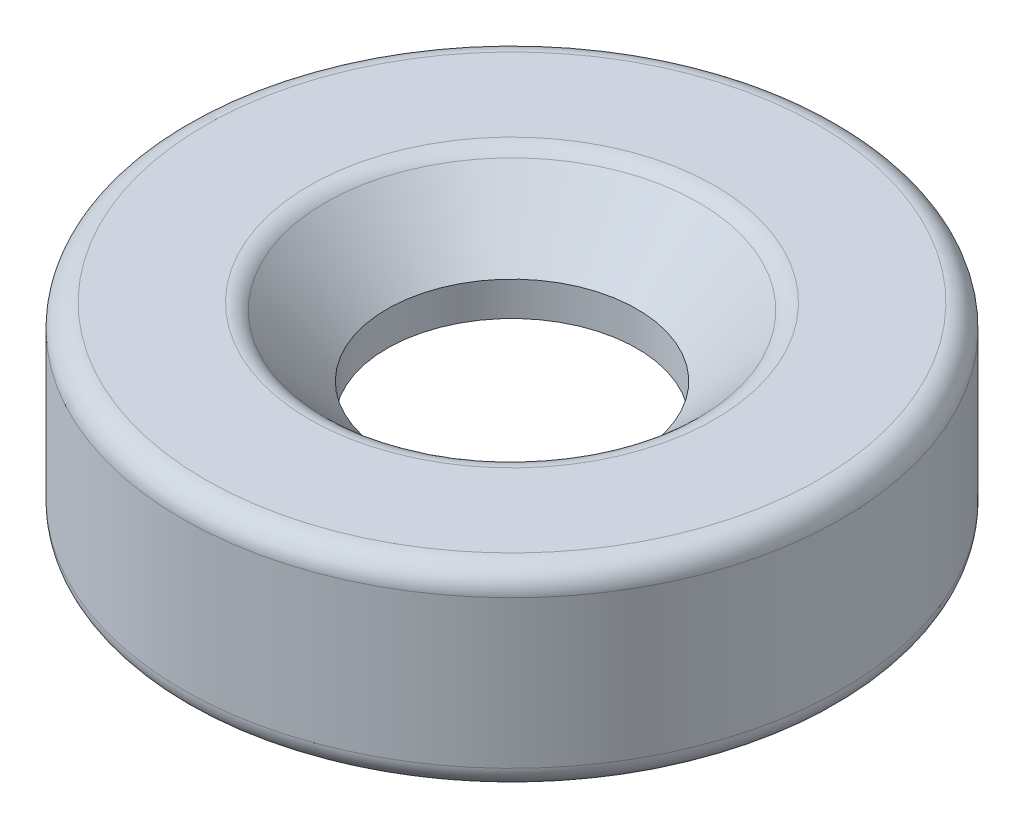
ISO-10303-21;
HEADER;
FILE_DESCRIPTION(('STEP AP214'),'2;1');
FILE_NAME('part.step','',(''),(''),'','','');
FILE_SCHEMA(('AUTOMOTIVE_DESIGN { 1 0 10303 214 1 1 1 1 }'));
ENDSEC;
DATA;
#1=APPLICATION_CONTEXT('core data for automotive mechanical design processes');
#2=APPLICATION_PROTOCOL_DEFINITION('international standard','automotive_design',2000,#1);
#3=PRODUCT_CONTEXT('',#1,'mechanical');
#4=PRODUCT('Part','Part','',(#3));
#5=PRODUCT_RELATED_PRODUCT_CATEGORY('part','',(#4));
#6=PRODUCT_DEFINITION_FORMATION('','',#4);
#7=PRODUCT_DEFINITION_CONTEXT('part definition',#1,'design');
#8=PRODUCT_DEFINITION('design','',#6,#7);
#9=PRODUCT_DEFINITION_SHAPE('','',#8);
#10=(LENGTH_UNIT() NAMED_UNIT(*) SI_UNIT(.MILLI.,.METRE.));
#11=(NAMED_UNIT(*) PLANE_ANGLE_UNIT() SI_UNIT($,.RADIAN.));
#12=(NAMED_UNIT(*) SI_UNIT($,.STERADIAN.) SOLID_ANGLE_UNIT());
#13=UNCERTAINTY_MEASURE_WITH_UNIT(LENGTH_MEASURE(1.E-05),#10,'distance_accuracy_value','');
#14=(GEOMETRIC_REPRESENTATION_CONTEXT(3) GLOBAL_UNCERTAINTY_ASSIGNED_CONTEXT((#13)) GLOBAL_UNIT_ASSIGNED_CONTEXT((#10,
#11,#12)) REPRESENTATION_CONTEXT('',''));
#15=CARTESIAN_POINT('',(0.,0.,0.));
#16=DIRECTION('',(0.,0.,1.));
#17=DIRECTION('',(1.,0.,0.));
#18=AXIS2_PLACEMENT_3D('',#15,#16,#17);
#19=CARTESIAN_POINT('',(0.,10.8346474678292,0.));
#20=DIRECTION('',(0.,1.,0.));
#21=DIRECTION('',(0.,0.,1.));
#22=AXIS2_PLACEMENT_3D('',#19,#20,#21);
#23=CYLINDRICAL_SURFACE('',#22,14.5);
#24=CARTESIAN_POINT('',(0.,0.999999999999999,0.));
#25=DIRECTION('',(0.,-1.,0.));
#26=DIRECTION('',(0.,0.,-1.));
#27=AXIS2_PLACEMENT_3D('',#24,#25,#26);
#28=CIRCLE('',#27,14.5);
#29=CARTESIAN_POINT('',(0.,0.999999999999999,-14.5));
#30=VERTEX_POINT('',#29);
#31=EDGE_CURVE('E40',#30,#30,#28,.F.);
#32=ORIENTED_EDGE('',*,*,#31,.T.);
#33=EDGE_LOOP('',(#32));
#34=FACE_BOUND('',#33,.T.);
#35=CARTESIAN_POINT('',(0.,7.5,0.));
#36=DIRECTION('',(0.,1.,0.));
#37=DIRECTION('',(0.,0.,1.));
#38=AXIS2_PLACEMENT_3D('',#35,#36,#37);
#39=CIRCLE('',#38,14.5);
#40=CARTESIAN_POINT('',(0.,7.5,14.5));
#41=VERTEX_POINT('',#40);
#42=EDGE_CURVE('E44',#41,#41,#39,.F.);
#43=ORIENTED_EDGE('',*,*,#42,.T.);
#44=EDGE_LOOP('',(#43));
#45=FACE_BOUND('',#44,.T.);
#46=ADVANCED_FACE('F33',(#34,#45),#23,.T.);
#47=CARTESIAN_POINT('',(-14.5,8.5,0.));
#48=DIRECTION('',(0.,1.,0.));
#49=DIRECTION('',(0.,0.,1.));
#50=AXIS2_PLACEMENT_3D('',#47,#48,#49);
#51=PLANE('',#50);
#52=CARTESIAN_POINT('',(0.,8.5,0.));
#53=DIRECTION('',(0.,1.,0.));
#54=DIRECTION('',(0.,0.,1.));
#55=AXIS2_PLACEMENT_3D('',#52,#53,#54);
#56=CIRCLE('',#55,8.91421356237311);
#57=CARTESIAN_POINT('',(0.,8.5,8.91421356237311));
#58=VERTEX_POINT('',#57);
#59=EDGE_CURVE('E48',#58,#58,#56,.F.);
#60=ORIENTED_EDGE('',*,*,#59,.T.);
#61=EDGE_LOOP('',(#60));
#62=FACE_BOUND('',#61,.T.);
#63=CARTESIAN_POINT('',(0.,8.5,0.));
#64=DIRECTION('',(0.,1.,0.));
#65=DIRECTION('',(0.,0.,1.));
#66=AXIS2_PLACEMENT_3D('',#63,#64,#65);
#67=CIRCLE('',#66,13.5);
#68=CARTESIAN_POINT('',(0.,8.5,13.5));
#69=VERTEX_POINT('',#68);
#70=EDGE_CURVE('E53',#69,#69,#67,.T.);
#71=ORIENTED_EDGE('',*,*,#70,.T.);
#72=EDGE_LOOP('',(#71));
#73=FACE_BOUND('',#72,.T.);
#74=ADVANCED_FACE('F96',(#62,#73),#51,.T.);
#75=CARTESIAN_POINT('',(0.,5.5,0.));
#76=DIRECTION('',(0.,1.,0.));
#77=DIRECTION('',(0.,0.,1.));
#78=AXIS2_PLACEMENT_3D('',#75,#76,#77);
#79=CONICAL_SURFACE('',#78,5.5,0.78539816339745);
#80=CARTESIAN_POINT('',(0.,8.20710678118655,0.));
#81=DIRECTION('',(0.,-1.,0.));
#82=DIRECTION('',(0.,0.,-1.));
#83=AXIS2_PLACEMENT_3D('',#80,#81,#82);
#84=CIRCLE('',#83,8.20710678118656);
#85=CARTESIAN_POINT('',(0.,8.20710678118655,-8.20710678118656));
#86=VERTEX_POINT('',#85);
#87=EDGE_CURVE('E56',#86,#86,#84,.F.);
#88=ORIENTED_EDGE('',*,*,#87,.T.);
#89=EDGE_LOOP('',(#88));
#90=FACE_BOUND('',#89,.T.);
#91=CARTESIAN_POINT('',(0.,5.5,0.));
#92=DIRECTION('',(0.,1.,0.));
#93=DIRECTION('',(0.,0.,1.));
#94=AXIS2_PLACEMENT_3D('',#91,#92,#93);
#95=CIRCLE('',#94,5.5);
#96=CARTESIAN_POINT('',(0.,5.5,5.5));
#97=VERTEX_POINT('',#96);
#98=EDGE_CURVE('E59',#97,#97,#95,.T.);
#99=ORIENTED_EDGE('',*,*,#98,.F.);
#100=EDGE_LOOP('',(#99));
#101=FACE_BOUND('',#100,.T.);
#102=ADVANCED_FACE('F101',(#90,#101),#79,.F.);
#103=CARTESIAN_POINT('',(0.,10.8346474678292,0.));
#104=DIRECTION('',(0.,1.,0.));
#105=DIRECTION('',(0.,0.,1.));
#106=AXIS2_PLACEMENT_3D('',#103,#104,#105);
#107=CYLINDRICAL_SURFACE('',#106,5.5);
#108=ORIENTED_EDGE('',*,*,#98,.T.);
#109=EDGE_LOOP('',(#108));
#110=FACE_BOUND('',#109,.T.);
#111=CARTESIAN_POINT('',(0.,4.,0.));
#112=DIRECTION('',(0.,1.,0.));
#113=DIRECTION('',(0.,0.,1.));
#114=AXIS2_PLACEMENT_3D('',#111,#112,#113);
#115=CIRCLE('',#114,5.5);
#116=CARTESIAN_POINT('',(0.,4.,5.5));
#117=VERTEX_POINT('',#116);
#118=EDGE_CURVE('E63',#117,#117,#115,.T.);
#119=ORIENTED_EDGE('',*,*,#118,.F.);
#120=EDGE_LOOP('',(#119));
#121=FACE_BOUND('',#120,.T.);
#122=ADVANCED_FACE('F152',(#110,#121),#107,.F.);
#123=CARTESIAN_POINT('',(-5.5,4.,0.));
#124=DIRECTION('',(0.,-1.,0.));
#125=DIRECTION('',(0.,0.,-1.));
#126=AXIS2_PLACEMENT_3D('',#123,#124,#125);
#127=PLANE('',#126);
#128=CARTESIAN_POINT('',(0.,4.,0.));
#129=DIRECTION('',(0.,-1.,0.));
#130=DIRECTION('',(0.,0.,-1.));
#131=AXIS2_PLACEMENT_3D('',#128,#129,#130);
#132=CIRCLE('',#131,7.91198464163823);
#133=CARTESIAN_POINT('',(0.,4.,-7.91198464163823));
#134=VERTEX_POINT('',#133);
#135=EDGE_CURVE('E60',#134,#134,#132,.F.);
#136=ORIENTED_EDGE('',*,*,#135,.F.);
#137=EDGE_LOOP('',(#136));
#138=FACE_BOUND('',#137,.T.);
#139=ORIENTED_EDGE('',*,*,#118,.T.);
#140=EDGE_LOOP('',(#139));
#141=FACE_BOUND('',#140,.T.);
#142=ADVANCED_FACE('F140',(#138,#141),#127,.T.);
#143=CARTESIAN_POINT('',(-8.5,0.,0.));
#144=DIRECTION('',(0.,-1.,0.));
#145=DIRECTION('',(0.,0.,-1.));
#146=AXIS2_PLACEMENT_3D('',#143,#144,#145);
#147=PLANE('',#146);
#148=CARTESIAN_POINT('',(0.,0.,0.));
#149=DIRECTION('',(0.,-1.,0.));
#150=DIRECTION('',(0.,0.,-1.));
#151=AXIS2_PLACEMENT_3D('',#148,#149,#150);
#152=CIRCLE('',#151,13.5);
#153=CARTESIAN_POINT('',(0.,0.,-13.5));
#154=VERTEX_POINT('',#153);
#155=EDGE_CURVE('E10',#154,#154,#152,.T.);
#156=ORIENTED_EDGE('',*,*,#155,.T.);
#157=EDGE_LOOP('',(#156));
#158=FACE_BOUND('',#157,.T.);
#159=CARTESIAN_POINT('',(0.,0.,0.));
#160=DIRECTION('',(0.,1.,0.));
#161=DIRECTION('',(0.,0.,1.));
#162=AXIS2_PLACEMENT_3D('',#159,#160,#161);
#163=CIRCLE('',#162,12.7);
#164=CARTESIAN_POINT('',(0.,0.,12.7));
#165=VERTEX_POINT('',#164);
#166=EDGE_CURVE('E64',#165,#165,#163,.T.);
#167=ORIENTED_EDGE('',*,*,#166,.T.);
#168=EDGE_LOOP('',(#167));
#169=FACE_BOUND('',#168,.T.);
#170=ADVANCED_FACE('F135',(#158,#169),#147,.T.);
#171=CARTESIAN_POINT('',(0.,1.5230716203771,0.));
#172=DIRECTION('',(0.,-1.,0.));
#173=DIRECTION('',(0.,0.,-1.));
#174=AXIS2_PLACEMENT_3D('',#171,#172,#173);
#175=CONICAL_SURFACE('',#174,12.6468131670254,0.034906585039882);
#176=ORIENTED_EDGE('',*,*,#166,.F.);
#177=EDGE_LOOP('',(#176));
#178=FACE_BOUND('',#177,.T.);
#179=CARTESIAN_POINT('',(0.,1.5230716203771,0.));
#180=DIRECTION('',(0.,1.,0.));
#181=DIRECTION('',(0.,0.,1.));
#182=AXIS2_PLACEMENT_3D('',#179,#180,#181);
#183=CIRCLE('',#182,12.6468131670254);
#184=CARTESIAN_POINT('',(0.,1.5230716203771,12.6468131670254));
#185=VERTEX_POINT('',#184);
#186=EDGE_CURVE('E71',#185,#185,#183,.T.);
#187=ORIENTED_EDGE('',*,*,#186,.T.);
#188=EDGE_LOOP('',(#187));
#189=FACE_BOUND('',#188,.T.);
#190=ADVANCED_FACE('F92',(#178,#189),#175,.F.);
#191=CARTESIAN_POINT('',(0.,1.39749963130061,0.));
#192=DIRECTION('',(0.,1.,0.));
#193=DIRECTION('',(0.,0.,1.));
#194=AXIS2_PLACEMENT_3D('',#191,#192,#193);
#195=TOROIDAL_SURFACE('',#194,9.05090188259084,3.59810315165705);
#196=ORIENTED_EDGE('',*,*,#186,.F.);
#197=EDGE_LOOP('',(#196));
#198=FACE_BOUND('',#197,.T.);
#199=CARTESIAN_POINT('',(0.,4.9911,0.));
#200=DIRECTION('',(0.,1.,0.));
#201=DIRECTION('',(0.,0.,1.));
#202=AXIS2_PLACEMENT_3D('',#199,#200,#201);
#203=CIRCLE('',#202,8.87095);
#204=CARTESIAN_POINT('',(0.,4.9911,8.87095));
#205=VERTEX_POINT('',#204);
#206=EDGE_CURVE('E74',#205,#205,#203,.T.);
#207=ORIENTED_EDGE('',*,*,#206,.T.);
#208=EDGE_LOOP('',(#207));
#209=FACE_BOUND('',#208,.T.);
#210=ADVANCED_FACE('F78',(#198,#209),#195,.F.);
#211=CARTESIAN_POINT('',(0.,1.27,0.));
#212=DIRECTION('',(0.,1.,0.));
#213=DIRECTION('',(0.,0.,1.));
#214=AXIS2_PLACEMENT_3D('',#211,#212,#213);
#215=CONICAL_SURFACE('',#214,5.2705,0.768920903667771);
#216=ORIENTED_EDGE('',*,*,#135,.T.);
#217=EDGE_LOOP('',(#216));
#218=FACE_BOUND('',#217,.T.);
#219=ORIENTED_EDGE('',*,*,#206,.F.);
#220=EDGE_LOOP('',(#219));
#221=FACE_BOUND('',#220,.T.);
#222=ADVANCED_FACE('F80',(#218,#221),#215,.T.);
#223=CARTESIAN_POINT('',(0.,7.5,0.));
#224=DIRECTION('',(0.,1.,0.));
#225=DIRECTION('',(0.,0.,1.));
#226=AXIS2_PLACEMENT_3D('',#223,#224,#225);
#227=TOROIDAL_SURFACE('',#226,8.91421356237311,1.);
#228=ORIENTED_EDGE('',*,*,#59,.F.);
#229=EDGE_LOOP('',(#228));
#230=FACE_BOUND('',#229,.T.);
#231=ORIENTED_EDGE('',*,*,#87,.F.);
#232=EDGE_LOOP('',(#231));
#233=FACE_BOUND('',#232,.T.);
#234=ADVANCED_FACE('F82',(#230,#233),#227,.T.);
#235=CARTESIAN_POINT('',(0.,0.999999999999999,0.));
#236=DIRECTION('',(0.,-1.,0.));
#237=DIRECTION('',(0.,0.,-1.));
#238=AXIS2_PLACEMENT_3D('',#235,#236,#237);
#239=TOROIDAL_SURFACE('',#238,13.5,1.);
#240=ORIENTED_EDGE('',*,*,#155,.F.);
#241=EDGE_LOOP('',(#240));
#242=FACE_BOUND('',#241,.T.);
#243=ORIENTED_EDGE('',*,*,#31,.F.);
#244=EDGE_LOOP('',(#243));
#245=FACE_BOUND('',#244,.T.);
#246=ADVANCED_FACE('F89',(#242,#245),#239,.T.);
#247=CARTESIAN_POINT('',(0.,7.5,0.));
#248=DIRECTION('',(0.,1.,0.));
#249=DIRECTION('',(0.,0.,1.));
#250=AXIS2_PLACEMENT_3D('',#247,#248,#249);
#251=TOROIDAL_SURFACE('',#250,13.5,1.);
#252=ORIENTED_EDGE('',*,*,#42,.F.);
#253=EDGE_LOOP('',(#252));
#254=FACE_BOUND('',#253,.T.);
#255=ORIENTED_EDGE('',*,*,#70,.F.);
#256=EDGE_LOOP('',(#255));
#257=FACE_BOUND('',#256,.T.);
#258=ADVANCED_FACE('F35',(#254,#257),#251,.T.);
#259=CLOSED_SHELL('',(#46,#74,#102,#122,#142,#170,#190,#210,#222,#234,#246,#258));
#260=MANIFOLD_SOLID_BREP('B2',#259);
#261=ADVANCED_BREP_SHAPE_REPRESENTATION('',(#18,#260),#14);
#262=SHAPE_DEFINITION_REPRESENTATION(#9,#261);
ENDSEC;
END-ISO-10303-21;
